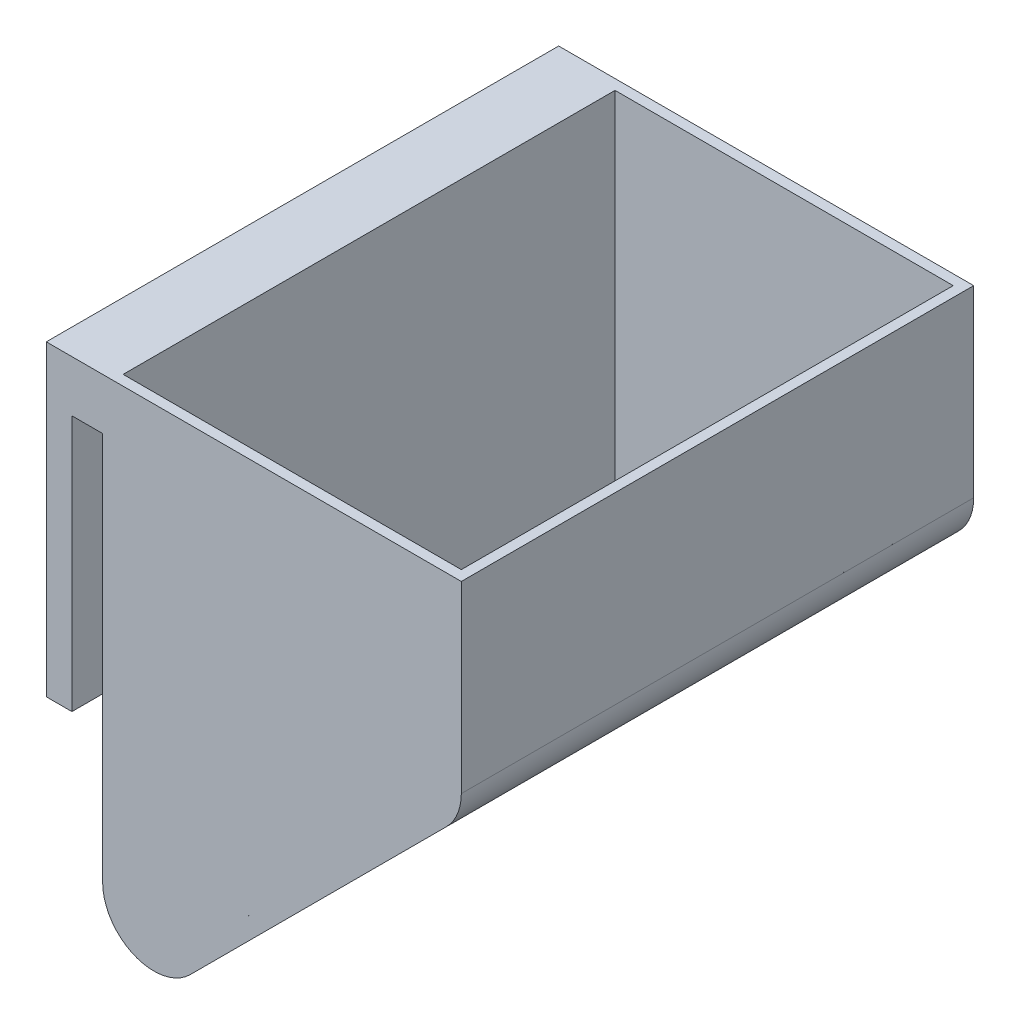
ISO-10303-21;
HEADER;
FILE_DESCRIPTION(('STEP AP214'),'2;1');
FILE_NAME('part.step','',(''),(''),'','','');
FILE_SCHEMA(('AUTOMOTIVE_DESIGN { 1 0 10303 214 1 1 1 1 }'));
ENDSEC;
DATA;
#1=APPLICATION_CONTEXT('core data for automotive mechanical design processes');
#2=APPLICATION_PROTOCOL_DEFINITION('international standard','automotive_design',2000,#1);
#3=PRODUCT_CONTEXT('',#1,'mechanical');
#4=PRODUCT('Part','Part','',(#3));
#5=PRODUCT_RELATED_PRODUCT_CATEGORY('part','',(#4));
#6=PRODUCT_DEFINITION_FORMATION('','',#4);
#7=PRODUCT_DEFINITION_CONTEXT('part definition',#1,'design');
#8=PRODUCT_DEFINITION('design','',#6,#7);
#9=PRODUCT_DEFINITION_SHAPE('','',#8);
#10=(LENGTH_UNIT() NAMED_UNIT(*) SI_UNIT(.MILLI.,.METRE.));
#11=(NAMED_UNIT(*) PLANE_ANGLE_UNIT() SI_UNIT($,.RADIAN.));
#12=(NAMED_UNIT(*) SI_UNIT($,.STERADIAN.) SOLID_ANGLE_UNIT());
#13=UNCERTAINTY_MEASURE_WITH_UNIT(LENGTH_MEASURE(1.E-05),#10,'distance_accuracy_value','');
#14=(GEOMETRIC_REPRESENTATION_CONTEXT(3) GLOBAL_UNCERTAINTY_ASSIGNED_CONTEXT((#13)) GLOBAL_UNIT_ASSIGNED_CONTEXT((#10,
#11,#12)) REPRESENTATION_CONTEXT('',''));
#15=CARTESIAN_POINT('',(0.,0.,0.));
#16=DIRECTION('',(0.,0.,1.));
#17=DIRECTION('',(1.,0.,0.));
#18=AXIS2_PLACEMENT_3D('',#15,#16,#17);
#19=CARTESIAN_POINT('',(-11.,0.,100.));
#20=DIRECTION('',(0.,-1.,0.));
#21=DIRECTION('',(1.,0.,0.));
#22=AXIS2_PLACEMENT_3D('',#19,#20,#21);
#23=PLANE('',#22);
#24=DIRECTION('',(1.,0.,0.));
#25=VECTOR('',#24,1.);
#26=CARTESIAN_POINT('',(2.00000000000001,0.,98.));
#27=LINE('',#26,#25);
#28=CARTESIAN_POINT('',(2.00000000000001,0.,98.));
#29=VERTEX_POINT('',#28);
#30=CARTESIAN_POINT('',(68.,0.,98.));
#31=VERTEX_POINT('',#30);
#32=EDGE_CURVE('E167',#29,#31,#27,.T.);
#33=ORIENTED_EDGE('',*,*,#32,.F.);
#34=DIRECTION('',(0.,0.,1.));
#35=VECTOR('',#34,1.);
#36=CARTESIAN_POINT('',(2.00000000000002,0.,2.));
#37=LINE('',#36,#35);
#38=CARTESIAN_POINT('',(2.00000000000002,0.,2.));
#39=VERTEX_POINT('',#38);
#40=EDGE_CURVE('E173',#39,#29,#37,.T.);
#41=ORIENTED_EDGE('',*,*,#40,.F.);
#42=DIRECTION('',(-1.,0.,0.));
#43=VECTOR('',#42,1.);
#44=CARTESIAN_POINT('',(2.00000000000002,0.,2.));
#45=LINE('',#44,#43);
#46=CARTESIAN_POINT('',(68.,0.,2.));
#47=VERTEX_POINT('',#46);
#48=EDGE_CURVE('E177',#47,#39,#45,.T.);
#49=ORIENTED_EDGE('',*,*,#48,.F.);
#50=DIRECTION('',(0.,0.,-1.));
#51=VECTOR('',#50,1.);
#52=CARTESIAN_POINT('',(68.,0.,2.));
#53=LINE('',#52,#51);
#54=EDGE_CURVE('E158',#31,#47,#53,.T.);
#55=ORIENTED_EDGE('',*,*,#54,.F.);
#56=EDGE_LOOP('',(#33,#41,#49,#55));
#57=FACE_BOUND('',#56,.T.);
#58=DIRECTION('',(-1.,0.,0.));
#59=VECTOR('',#58,1.);
#60=CARTESIAN_POINT('',(-11.,0.,0.));
#61=LINE('',#60,#59);
#62=CARTESIAN_POINT('',(70.,0.,0.));
#63=VERTEX_POINT('',#62);
#64=CARTESIAN_POINT('',(-11.,0.,0.));
#65=VERTEX_POINT('',#64);
#66=EDGE_CURVE('E184',#63,#65,#61,.T.);
#67=ORIENTED_EDGE('',*,*,#66,.T.);
#68=DIRECTION('',(0.,0.,-1.));
#69=VECTOR('',#68,1.);
#70=CARTESIAN_POINT('',(-11.,0.,100.));
#71=LINE('',#70,#69);
#72=CARTESIAN_POINT('',(-11.,0.,100.));
#73=VERTEX_POINT('',#72);
#74=EDGE_CURVE('E235',#73,#65,#71,.T.);
#75=ORIENTED_EDGE('',*,*,#74,.F.);
#76=DIRECTION('',(-1.,0.,0.));
#77=VECTOR('',#76,1.);
#78=CARTESIAN_POINT('',(-11.,0.,100.));
#79=LINE('',#78,#77);
#80=CARTESIAN_POINT('',(70.,0.,100.));
#81=VERTEX_POINT('',#80);
#82=EDGE_CURVE('E187',#81,#73,#79,.T.);
#83=ORIENTED_EDGE('',*,*,#82,.F.);
#84=DIRECTION('',(0.,0.,-1.));
#85=VECTOR('',#84,1.);
#86=CARTESIAN_POINT('',(70.,0.,100.));
#87=LINE('',#86,#85);
#88=EDGE_CURVE('E205',#81,#63,#87,.T.);
#89=ORIENTED_EDGE('',*,*,#88,.T.);
#90=EDGE_LOOP('',(#67,#75,#83,#89));
#91=FACE_BOUND('',#90,.T.);
#92=ADVANCED_FACE('F37',(#57,#91),#23,.F.);
#93=CARTESIAN_POINT('',(-11.,0.,100.));
#94=DIRECTION('',(1.,0.,0.));
#95=DIRECTION('',(0.,1.,0.));
#96=AXIS2_PLACEMENT_3D('',#93,#94,#95);
#97=PLANE('',#96);
#98=DIRECTION('',(0.,-1.,0.));
#99=VECTOR('',#98,1.);
#100=CARTESIAN_POINT('',(-11.,0.,0.));
#101=LINE('',#100,#99);
#102=CARTESIAN_POINT('',(-11.,-60.,0.));
#103=VERTEX_POINT('',#102);
#104=EDGE_CURVE('E208',#65,#103,#101,.T.);
#105=ORIENTED_EDGE('',*,*,#104,.T.);
#106=DIRECTION('',(0.,0.,-1.));
#107=VECTOR('',#106,1.);
#108=CARTESIAN_POINT('',(-11.,-60.,100.));
#109=LINE('',#108,#107);
#110=CARTESIAN_POINT('',(-11.,-60.,100.));
#111=VERTEX_POINT('',#110);
#112=EDGE_CURVE('E232',#111,#103,#109,.T.);
#113=ORIENTED_EDGE('',*,*,#112,.F.);
#114=DIRECTION('',(0.,-1.,0.));
#115=VECTOR('',#114,1.);
#116=CARTESIAN_POINT('',(-11.,0.,100.));
#117=LINE('',#116,#115);
#118=EDGE_CURVE('E190',#73,#111,#117,.T.);
#119=ORIENTED_EDGE('',*,*,#118,.F.);
#120=ORIENTED_EDGE('',*,*,#74,.T.);
#121=EDGE_LOOP('',(#105,#113,#119,#120));
#122=FACE_BOUND('',#121,.T.);
#123=ADVANCED_FACE('F302',(#122),#97,.F.);
#124=CARTESIAN_POINT('',(-11.,-60.,100.));
#125=DIRECTION('',(0.,1.,0.));
#126=DIRECTION('',(0.,0.,1.));
#127=AXIS2_PLACEMENT_3D('',#124,#125,#126);
#128=PLANE('',#127);
#129=DIRECTION('',(1.,0.,0.));
#130=VECTOR('',#129,1.);
#131=CARTESIAN_POINT('',(-11.,-60.,0.));
#132=LINE('',#131,#130);
#133=CARTESIAN_POINT('',(-6.,-60.,0.));
#134=VERTEX_POINT('',#133);
#135=EDGE_CURVE('E210',#103,#134,#132,.T.);
#136=ORIENTED_EDGE('',*,*,#135,.T.);
#137=DIRECTION('',(0.,0.,-1.));
#138=VECTOR('',#137,1.);
#139=CARTESIAN_POINT('',(-6.,-60.,100.));
#140=LINE('',#139,#138);
#141=CARTESIAN_POINT('',(-6.,-60.,100.));
#142=VERTEX_POINT('',#141);
#143=EDGE_CURVE('E229',#142,#134,#140,.T.);
#144=ORIENTED_EDGE('',*,*,#143,.F.);
#145=DIRECTION('',(1.,0.,0.));
#146=VECTOR('',#145,1.);
#147=CARTESIAN_POINT('',(-11.,-60.,100.));
#148=LINE('',#147,#146);
#149=EDGE_CURVE('E193',#111,#142,#148,.T.);
#150=ORIENTED_EDGE('',*,*,#149,.F.);
#151=ORIENTED_EDGE('',*,*,#112,.T.);
#152=EDGE_LOOP('',(#136,#144,#150,#151));
#153=FACE_BOUND('',#152,.T.);
#154=ADVANCED_FACE('F306',(#153),#128,.F.);
#155=CARTESIAN_POINT('',(-6.,-60.,100.));
#156=DIRECTION('',(-1.,0.,0.));
#157=DIRECTION('',(0.,0.,1.));
#158=AXIS2_PLACEMENT_3D('',#155,#156,#157);
#159=PLANE('',#158);
#160=DIRECTION('',(0.,1.,0.));
#161=VECTOR('',#160,1.);
#162=CARTESIAN_POINT('',(-6.,-60.,0.));
#163=LINE('',#162,#161);
#164=CARTESIAN_POINT('',(-6.,-10.,0.));
#165=VERTEX_POINT('',#164);
#166=EDGE_CURVE('E212',#134,#165,#163,.T.);
#167=ORIENTED_EDGE('',*,*,#166,.T.);
#168=DIRECTION('',(0.,0.,-1.));
#169=VECTOR('',#168,1.);
#170=CARTESIAN_POINT('',(-6.,-10.,100.));
#171=LINE('',#170,#169);
#172=CARTESIAN_POINT('',(-6.,-10.,100.));
#173=VERTEX_POINT('',#172);
#174=EDGE_CURVE('E226',#173,#165,#171,.T.);
#175=ORIENTED_EDGE('',*,*,#174,.F.);
#176=DIRECTION('',(0.,1.,0.));
#177=VECTOR('',#176,1.);
#178=CARTESIAN_POINT('',(-6.,-60.,100.));
#179=LINE('',#178,#177);
#180=EDGE_CURVE('E195',#142,#173,#179,.T.);
#181=ORIENTED_EDGE('',*,*,#180,.F.);
#182=ORIENTED_EDGE('',*,*,#143,.T.);
#183=EDGE_LOOP('',(#167,#175,#181,#182));
#184=FACE_BOUND('',#183,.T.);
#185=ADVANCED_FACE('F312',(#184),#159,.F.);
#186=CARTESIAN_POINT('',(-6.,-10.,100.));
#187=DIRECTION('',(0.,1.,0.));
#188=DIRECTION('',(-1.,0.,0.));
#189=AXIS2_PLACEMENT_3D('',#186,#187,#188);
#190=PLANE('',#189);
#191=DIRECTION('',(1.,0.,0.));
#192=VECTOR('',#191,1.);
#193=CARTESIAN_POINT('',(-6.,-10.,0.));
#194=LINE('',#193,#192);
#195=CARTESIAN_POINT('',(0.,-10.,0.));
#196=VERTEX_POINT('',#195);
#197=EDGE_CURVE('E214',#165,#196,#194,.T.);
#198=ORIENTED_EDGE('',*,*,#197,.T.);
#199=DIRECTION('',(0.,0.,-1.));
#200=VECTOR('',#199,1.);
#201=CARTESIAN_POINT('',(0.,-10.,100.));
#202=LINE('',#201,#200);
#203=CARTESIAN_POINT('',(0.,-10.,100.));
#204=VERTEX_POINT('',#203);
#205=EDGE_CURVE('E223',#204,#196,#202,.T.);
#206=ORIENTED_EDGE('',*,*,#205,.F.);
#207=DIRECTION('',(1.,0.,0.));
#208=VECTOR('',#207,1.);
#209=CARTESIAN_POINT('',(-6.,-10.,100.));
#210=LINE('',#209,#208);
#211=EDGE_CURVE('E197',#173,#204,#210,.T.);
#212=ORIENTED_EDGE('',*,*,#211,.F.);
#213=ORIENTED_EDGE('',*,*,#174,.T.);
#214=EDGE_LOOP('',(#198,#206,#212,#213));
#215=FACE_BOUND('',#214,.T.);
#216=ADVANCED_FACE('F316',(#215),#190,.F.);
#217=CARTESIAN_POINT('',(0.,-10.,100.));
#218=DIRECTION('',(1.,0.,0.));
#219=DIRECTION('',(0.,1.,0.));
#220=AXIS2_PLACEMENT_3D('',#217,#218,#219);
#221=PLANE('',#220);
#222=DIRECTION('',(0.,-1.,0.));
#223=VECTOR('',#222,1.);
#224=CARTESIAN_POINT('',(0.,-10.,0.));
#225=LINE('',#224,#223);
#226=CARTESIAN_POINT('',(0.,-85.8578643762689,0.));
#227=VERTEX_POINT('',#226);
#228=EDGE_CURVE('E216',#196,#227,#225,.T.);
#229=ORIENTED_EDGE('',*,*,#228,.T.);
#230=DIRECTION('',(0.,0.,-1.));
#231=VECTOR('',#230,1.);
#232=CARTESIAN_POINT('',(0.,-85.8578643762689,100.));
#233=LINE('',#232,#231);
#234=CARTESIAN_POINT('',(0.,-85.8578643762689,100.));
#235=VERTEX_POINT('',#234);
#236=EDGE_CURVE('E11',#227,#235,#233,.F.);
#237=ORIENTED_EDGE('',*,*,#236,.T.);
#238=DIRECTION('',(0.,-1.,0.));
#239=VECTOR('',#238,1.);
#240=CARTESIAN_POINT('',(0.,-10.,100.));
#241=LINE('',#240,#239);
#242=EDGE_CURVE('E199',#204,#235,#241,.T.);
#243=ORIENTED_EDGE('',*,*,#242,.F.);
#244=ORIENTED_EDGE('',*,*,#205,.T.);
#245=EDGE_LOOP('',(#229,#237,#243,#244));
#246=FACE_BOUND('',#245,.T.);
#247=ADVANCED_FACE('F320',(#246),#221,.F.);
#248=CARTESIAN_POINT('',(0.,-110.,100.));
#249=DIRECTION('',(-0.707106781186552,0.707106781186543,0.));
#250=DIRECTION('',(-0.707106781186543,-0.707106781186552,0.));
#251=AXIS2_PLACEMENT_3D('',#248,#249,#250);
#252=PLANE('',#251);
#253=DIRECTION('',(0.707106781186543,0.707106781186552,0.));
#254=VECTOR('',#253,1.);
#255=CARTESIAN_POINT('',(0.,-110.,0.));
#256=LINE('',#255,#254);
#257=CARTESIAN_POINT('',(17.0710678118655,-92.9289321881343,0.));
#258=VERTEX_POINT('',#257);
#259=CARTESIAN_POINT('',(67.0710678118655,-42.9289321881337,0.));
#260=VERTEX_POINT('',#259);
#261=EDGE_CURVE('E218',#258,#260,#256,.T.);
#262=ORIENTED_EDGE('',*,*,#261,.T.);
#263=DIRECTION('',(0.,0.,-1.));
#264=VECTOR('',#263,1.);
#265=CARTESIAN_POINT('',(67.0710678118655,-42.9289321881337,100.));
#266=LINE('',#265,#264);
#267=CARTESIAN_POINT('',(67.0710678118655,-42.9289321881337,100.));
#268=VERTEX_POINT('',#267);
#269=EDGE_CURVE('E58',#260,#268,#266,.F.);
#270=ORIENTED_EDGE('',*,*,#269,.T.);
#271=DIRECTION('',(0.707106781186543,0.707106781186552,0.));
#272=VECTOR('',#271,1.);
#273=CARTESIAN_POINT('',(0.,-110.,100.));
#274=LINE('',#273,#272);
#275=CARTESIAN_POINT('',(17.0710678118655,-92.9289321881343,100.));
#276=VERTEX_POINT('',#275);
#277=EDGE_CURVE('E201',#276,#268,#274,.T.);
#278=ORIENTED_EDGE('',*,*,#277,.F.);
#279=DIRECTION('',(0.,0.,-1.));
#280=VECTOR('',#279,1.);
#281=CARTESIAN_POINT('',(17.0710678118655,-92.9289321881343,100.));
#282=LINE('',#281,#280);
#283=EDGE_CURVE('E259',#276,#258,#282,.T.);
#284=ORIENTED_EDGE('',*,*,#283,.T.);
#285=EDGE_LOOP('',(#262,#270,#278,#284));
#286=FACE_BOUND('',#285,.T.);
#287=ADVANCED_FACE('F324',(#286),#252,.F.);
#288=CARTESIAN_POINT('',(70.,0.,100.));
#289=DIRECTION('',(-1.,0.,0.));
#290=DIRECTION('',(0.,-1.,0.));
#291=AXIS2_PLACEMENT_3D('',#288,#289,#290);
#292=PLANE('',#291);
#293=DIRECTION('',(0.,1.,0.));
#294=VECTOR('',#293,1.);
#295=CARTESIAN_POINT('',(70.,0.,100.));
#296=LINE('',#295,#294);
#297=CARTESIAN_POINT('',(70.,-35.8578643762683,100.));
#298=VERTEX_POINT('',#297);
#299=EDGE_CURVE('E203',#298,#81,#296,.T.);
#300=ORIENTED_EDGE('',*,*,#299,.F.);
#301=DIRECTION('',(0.,0.,-1.));
#302=VECTOR('',#301,1.);
#303=CARTESIAN_POINT('',(70.,-35.8578643762683,100.));
#304=LINE('',#303,#302);
#305=CARTESIAN_POINT('',(70.,-35.8578643762683,0.));
#306=VERTEX_POINT('',#305);
#307=EDGE_CURVE('E252',#298,#306,#304,.T.);
#308=ORIENTED_EDGE('',*,*,#307,.T.);
#309=DIRECTION('',(0.,1.,0.));
#310=VECTOR('',#309,1.);
#311=CARTESIAN_POINT('',(70.,0.,0.));
#312=LINE('',#311,#310);
#313=EDGE_CURVE('E191',#306,#63,#312,.T.);
#314=ORIENTED_EDGE('',*,*,#313,.T.);
#315=ORIENTED_EDGE('',*,*,#88,.F.);
#316=EDGE_LOOP('',(#300,#308,#314,#315));
#317=FACE_BOUND('',#316,.T.);
#318=ADVANCED_FACE('F327',(#317),#292,.F.);
#319=CARTESIAN_POINT('',(0.,0.,100.));
#320=DIRECTION('',(0.,0.,-1.));
#321=DIRECTION('',(-1.,0.,0.));
#322=AXIS2_PLACEMENT_3D('',#319,#320,#321);
#323=PLANE('',#322);
#324=ORIENTED_EDGE('',*,*,#277,.T.);
#325=CARTESIAN_POINT('',(60.,-35.8578643762683,100.));
#326=DIRECTION('',(0.,0.,-1.));
#327=DIRECTION('',(-1.,0.,0.));
#328=AXIS2_PLACEMENT_3D('',#325,#326,#327);
#329=CIRCLE('',#328,10.);
#330=EDGE_CURVE('E265',#268,#298,#329,.F.);
#331=ORIENTED_EDGE('',*,*,#330,.T.);
#332=ORIENTED_EDGE('',*,*,#299,.T.);
#333=ORIENTED_EDGE('',*,*,#82,.T.);
#334=ORIENTED_EDGE('',*,*,#118,.T.);
#335=ORIENTED_EDGE('',*,*,#149,.T.);
#336=ORIENTED_EDGE('',*,*,#180,.T.);
#337=ORIENTED_EDGE('',*,*,#211,.T.);
#338=ORIENTED_EDGE('',*,*,#242,.T.);
#339=CARTESIAN_POINT('',(10.,-85.8578643762689,100.));
#340=DIRECTION('',(0.,0.,-1.));
#341=DIRECTION('',(-1.,0.,0.));
#342=AXIS2_PLACEMENT_3D('',#339,#340,#341);
#343=CIRCLE('',#342,10.);
#344=EDGE_CURVE('E263',#235,#276,#343,.F.);
#345=ORIENTED_EDGE('',*,*,#344,.T.);
#346=EDGE_LOOP('',(#324,#331,#332,#333,#334,#335,#336,#337,#338,#345));
#347=FACE_BOUND('',#346,.T.);
#348=ADVANCED_FACE('F330',(#347),#323,.F.);
#349=CARTESIAN_POINT('',(0.,0.,0.));
#350=DIRECTION('',(0.,0.,-1.));
#351=DIRECTION('',(-1.,0.,0.));
#352=AXIS2_PLACEMENT_3D('',#349,#350,#351);
#353=PLANE('',#352);
#354=ORIENTED_EDGE('',*,*,#313,.F.);
#355=CARTESIAN_POINT('',(60.,-35.8578643762683,0.));
#356=DIRECTION('',(0.,0.,-1.));
#357=DIRECTION('',(-1.,0.,0.));
#358=AXIS2_PLACEMENT_3D('',#355,#356,#357);
#359=CIRCLE('',#358,10.);
#360=EDGE_CURVE('E257',#306,#260,#359,.T.);
#361=ORIENTED_EDGE('',*,*,#360,.T.);
#362=ORIENTED_EDGE('',*,*,#261,.F.);
#363=CARTESIAN_POINT('',(10.,-85.8578643762689,0.));
#364=DIRECTION('',(0.,0.,-1.));
#365=DIRECTION('',(-1.,0.,0.));
#366=AXIS2_PLACEMENT_3D('',#363,#364,#365);
#367=CIRCLE('',#366,10.);
#368=EDGE_CURVE('E255',#258,#227,#367,.T.);
#369=ORIENTED_EDGE('',*,*,#368,.T.);
#370=ORIENTED_EDGE('',*,*,#228,.F.);
#371=ORIENTED_EDGE('',*,*,#197,.F.);
#372=ORIENTED_EDGE('',*,*,#166,.F.);
#373=ORIENTED_EDGE('',*,*,#135,.F.);
#374=ORIENTED_EDGE('',*,*,#104,.F.);
#375=ORIENTED_EDGE('',*,*,#66,.F.);
#376=EDGE_LOOP('',(#354,#361,#362,#369,#370,#371,#372,#373,#374,#375));
#377=FACE_BOUND('',#376,.T.);
#378=ADVANCED_FACE('F332',(#377),#353,.T.);
#379=CARTESIAN_POINT('',(2.00000000000002,-10.,2.));
#380=DIRECTION('',(-1.,0.,0.));
#381=DIRECTION('',(0.,-1.,0.));
#382=AXIS2_PLACEMENT_3D('',#379,#380,#381);
#383=PLANE('',#382);
#384=DIRECTION('',(0.,1.,0.));
#385=VECTOR('',#384,1.);
#386=CARTESIAN_POINT('',(2.00000000000001,-10.,98.));
#387=LINE('',#386,#385);
#388=CARTESIAN_POINT('',(2.00000000000003,-79.6169237196718,98.));
#389=VERTEX_POINT('',#388);
#390=EDGE_CURVE('E164',#389,#29,#387,.T.);
#391=ORIENTED_EDGE('',*,*,#390,.F.);
#392=DIRECTION('',(0.,0.,1.));
#393=VECTOR('',#392,1.);
#394=CARTESIAN_POINT('',(2.00000000000003,-79.6169237196718,1.99999999999993));
#395=LINE('',#394,#393);
#396=CARTESIAN_POINT('',(2.00000000000003,-79.6169237196718,2.));
#397=VERTEX_POINT('',#396);
#398=EDGE_CURVE('E45',#389,#397,#395,.F.);
#399=ORIENTED_EDGE('',*,*,#398,.T.);
#400=DIRECTION('',(0.,1.,0.));
#401=VECTOR('',#400,1.);
#402=CARTESIAN_POINT('',(2.00000000000002,-10.,2.));
#403=LINE('',#402,#401);
#404=EDGE_CURVE('E182',#397,#39,#403,.T.);
#405=ORIENTED_EDGE('',*,*,#404,.T.);
#406=ORIENTED_EDGE('',*,*,#40,.T.);
#407=EDGE_LOOP('',(#391,#399,#405,#406));
#408=FACE_BOUND('',#407,.T.);
#409=ADVANCED_FACE('F269',(#408),#383,.F.);
#410=CARTESIAN_POINT('',(2.00000000000002,-10.,2.));
#411=DIRECTION('',(0.,0.,-1.));
#412=DIRECTION('',(-1.,0.,0.));
#413=AXIS2_PLACEMENT_3D('',#410,#411,#412);
#414=PLANE('',#413);
#415=DIRECTION('',(0.70714199121114,0.707071569408603,0.));
#416=VECTOR('',#415,1.);
#417=CARTESIAN_POINT('',(2.00000000000002,-103.757359312881,1.99999999999993));
#418=LINE('',#417,#416);
#419=CARTESIAN_POINT('',(19.0707156940861,-86.6883436317832,1.99999999999993));
#420=VERTEX_POINT('',#419);
#421=CARTESIAN_POINT('',(65.070715694086,-40.6929246112144,1.99999999999993));
#422=VERTEX_POINT('',#421);
#423=EDGE_CURVE('E284',#420,#422,#418,.T.);
#424=ORIENTED_EDGE('',*,*,#423,.T.);
#425=CARTESIAN_POINT('',(58.,-33.621504699103,2.));
#426=DIRECTION('',(0.,0.,-1.));
#427=DIRECTION('',(-1.,0.,0.));
#428=AXIS2_PLACEMENT_3D('',#425,#426,#427);
#429=CIRCLE('',#428,10.);
#430=CARTESIAN_POINT('',(68.,-33.621504699103,2.));
#431=VERTEX_POINT('',#430);
#432=EDGE_CURVE('E250',#422,#431,#429,.F.);
#433=ORIENTED_EDGE('',*,*,#432,.T.);
#434=DIRECTION('',(0.,1.,0.));
#435=VECTOR('',#434,1.);
#436=CARTESIAN_POINT('',(68.,-9.99999999999999,2.));
#437=LINE('',#436,#435);
#438=EDGE_CURVE('E163',#431,#47,#437,.T.);
#439=ORIENTED_EDGE('',*,*,#438,.T.);
#440=ORIENTED_EDGE('',*,*,#48,.T.);
#441=ORIENTED_EDGE('',*,*,#404,.F.);
#442=CARTESIAN_POINT('',(12.,-79.6169237196718,2.));
#443=DIRECTION('',(0.,0.,-1.));
#444=DIRECTION('',(-1.,0.,0.));
#445=AXIS2_PLACEMENT_3D('',#442,#443,#444);
#446=CIRCLE('',#445,10.);
#447=EDGE_CURVE('E248',#397,#420,#446,.F.);
#448=ORIENTED_EDGE('',*,*,#447,.T.);
#449=EDGE_LOOP('',(#424,#433,#439,#440,#441,#448));
#450=FACE_BOUND('',#449,.T.);
#451=ADVANCED_FACE('F274',(#450),#414,.F.);
#452=CARTESIAN_POINT('',(68.,-9.99999999999999,2.));
#453=DIRECTION('',(1.,0.,0.));
#454=DIRECTION('',(0.,1.,0.));
#455=AXIS2_PLACEMENT_3D('',#452,#453,#454);
#456=PLANE('',#455);
#457=ORIENTED_EDGE('',*,*,#438,.F.);
#458=DIRECTION('',(0.,0.,1.));
#459=VECTOR('',#458,1.);
#460=CARTESIAN_POINT('',(68.,-33.621504699103,98.));
#461=LINE('',#460,#459);
#462=CARTESIAN_POINT('',(68.,-33.621504699103,98.));
#463=VERTEX_POINT('',#462);
#464=EDGE_CURVE('E161',#431,#463,#461,.T.);
#465=ORIENTED_EDGE('',*,*,#464,.T.);
#466=DIRECTION('',(0.,1.,0.));
#467=VECTOR('',#466,1.);
#468=CARTESIAN_POINT('',(68.,-9.99999999999999,98.));
#469=LINE('',#468,#467);
#470=EDGE_CURVE('E153',#463,#31,#469,.T.);
#471=ORIENTED_EDGE('',*,*,#470,.T.);
#472=ORIENTED_EDGE('',*,*,#54,.T.);
#473=EDGE_LOOP('',(#457,#465,#471,#472));
#474=FACE_BOUND('',#473,.T.);
#475=ADVANCED_FACE('F156',(#474),#456,.F.);
#476=CARTESIAN_POINT('',(2.00000000000001,-10.,98.));
#477=DIRECTION('',(0.,0.,1.));
#478=DIRECTION('',(1.,0.,0.));
#479=AXIS2_PLACEMENT_3D('',#476,#477,#478);
#480=PLANE('',#479);
#481=ORIENTED_EDGE('',*,*,#470,.F.);
#482=CARTESIAN_POINT('',(58.,-33.621504699103,98.));
#483=DIRECTION('',(0.,0.,1.));
#484=DIRECTION('',(1.,0.,0.));
#485=AXIS2_PLACEMENT_3D('',#482,#483,#484);
#486=CIRCLE('',#485,10.);
#487=CARTESIAN_POINT('',(65.070715694086,-40.6929246112144,98.));
#488=VERTEX_POINT('',#487);
#489=EDGE_CURVE('E241',#463,#488,#486,.F.);
#490=ORIENTED_EDGE('',*,*,#489,.T.);
#491=DIRECTION('',(0.70714199121114,0.707071569408603,0.));
#492=VECTOR('',#491,1.);
#493=CARTESIAN_POINT('',(2.00000000000002,-103.757359312881,98.));
#494=LINE('',#493,#492);
#495=CARTESIAN_POINT('',(19.0707156940861,-86.6883436317832,98.));
#496=VERTEX_POINT('',#495);
#497=EDGE_CURVE('E282',#496,#488,#494,.T.);
#498=ORIENTED_EDGE('',*,*,#497,.F.);
#499=CARTESIAN_POINT('',(12.,-79.6169237196718,98.));
#500=DIRECTION('',(0.,0.,1.));
#501=DIRECTION('',(1.,0.,0.));
#502=AXIS2_PLACEMENT_3D('',#499,#500,#501);
#503=CIRCLE('',#502,10.);
#504=EDGE_CURVE('E239',#496,#389,#503,.F.);
#505=ORIENTED_EDGE('',*,*,#504,.T.);
#506=ORIENTED_EDGE('',*,*,#390,.T.);
#507=ORIENTED_EDGE('',*,*,#32,.T.);
#508=EDGE_LOOP('',(#481,#490,#498,#505,#506,#507));
#509=FACE_BOUND('',#508,.T.);
#510=ADVANCED_FACE('F168',(#509),#480,.F.);
#511=CARTESIAN_POINT('',(2.00000000000002,-103.757359312881,1.99999999999993));
#512=DIRECTION('',(0.707071569408603,-0.70714199121114,0.));
#513=DIRECTION('',(0.70714199121114,0.707071569408603,0.));
#514=AXIS2_PLACEMENT_3D('',#511,#512,#513);
#515=PLANE('',#514);
#516=ORIENTED_EDGE('',*,*,#497,.T.);
#517=DIRECTION('',(0.,0.,1.));
#518=VECTOR('',#517,1.);
#519=CARTESIAN_POINT('',(65.070715694086,-40.6929246112144,1.99999999999993));
#520=LINE('',#519,#518);
#521=EDGE_CURVE('E246',#488,#422,#520,.F.);
#522=ORIENTED_EDGE('',*,*,#521,.T.);
#523=ORIENTED_EDGE('',*,*,#423,.F.);
#524=DIRECTION('',(0.,0.,1.));
#525=VECTOR('',#524,1.);
#526=CARTESIAN_POINT('',(19.0707156940861,-86.6883436317832,98.));
#527=LINE('',#526,#525);
#528=EDGE_CURVE('E243',#420,#496,#527,.T.);
#529=ORIENTED_EDGE('',*,*,#528,.T.);
#530=EDGE_LOOP('',(#516,#522,#523,#529));
#531=FACE_BOUND('',#530,.T.);
#532=ADVANCED_FACE('F281',(#531),#515,.F.);
#533=CARTESIAN_POINT('',(58.,-33.621504699103,2.));
#534=DIRECTION('',(0.,0.,-1.));
#535=DIRECTION('',(-1.,0.,0.));
#536=AXIS2_PLACEMENT_3D('',#533,#534,#535);
#537=CYLINDRICAL_SURFACE('',#536,10.);
#538=ORIENTED_EDGE('',*,*,#432,.F.);
#539=ORIENTED_EDGE('',*,*,#521,.F.);
#540=ORIENTED_EDGE('',*,*,#489,.F.);
#541=ORIENTED_EDGE('',*,*,#464,.F.);
#542=EDGE_LOOP('',(#538,#539,#540,#541));
#543=FACE_BOUND('',#542,.T.);
#544=ADVANCED_FACE('F289',(#543),#537,.F.);
#545=CARTESIAN_POINT('',(60.,-35.8578643762683,100.));
#546=DIRECTION('',(0.,0.,-1.));
#547=DIRECTION('',(-1.,0.,0.));
#548=AXIS2_PLACEMENT_3D('',#545,#546,#547);
#549=CYLINDRICAL_SURFACE('',#548,10.);
#550=ORIENTED_EDGE('',*,*,#330,.F.);
#551=ORIENTED_EDGE('',*,*,#269,.F.);
#552=ORIENTED_EDGE('',*,*,#360,.F.);
#553=ORIENTED_EDGE('',*,*,#307,.F.);
#554=EDGE_LOOP('',(#550,#551,#552,#553));
#555=FACE_BOUND('',#554,.T.);
#556=ADVANCED_FACE('F291',(#555),#549,.T.);
#557=CARTESIAN_POINT('',(12.,-79.6169237196718,1.99999999999993));
#558=DIRECTION('',(0.,0.,-1.));
#559=DIRECTION('',(-1.,0.,0.));
#560=AXIS2_PLACEMENT_3D('',#557,#558,#559);
#561=CYLINDRICAL_SURFACE('',#560,10.);
#562=ORIENTED_EDGE('',*,*,#447,.F.);
#563=ORIENTED_EDGE('',*,*,#398,.F.);
#564=ORIENTED_EDGE('',*,*,#504,.F.);
#565=ORIENTED_EDGE('',*,*,#528,.F.);
#566=EDGE_LOOP('',(#562,#563,#564,#565));
#567=FACE_BOUND('',#566,.T.);
#568=ADVANCED_FACE('F277',(#567),#561,.F.);
#569=CARTESIAN_POINT('',(10.,-85.8578643762689,100.));
#570=DIRECTION('',(0.,0.,-1.));
#571=DIRECTION('',(-1.,0.,0.));
#572=AXIS2_PLACEMENT_3D('',#569,#570,#571);
#573=CYLINDRICAL_SURFACE('',#572,10.);
#574=ORIENTED_EDGE('',*,*,#344,.F.);
#575=ORIENTED_EDGE('',*,*,#236,.F.);
#576=ORIENTED_EDGE('',*,*,#368,.F.);
#577=ORIENTED_EDGE('',*,*,#283,.F.);
#578=EDGE_LOOP('',(#574,#575,#576,#577));
#579=FACE_BOUND('',#578,.T.);
#580=ADVANCED_FACE('F39',(#579),#573,.T.);
#581=CLOSED_SHELL('',(#92,#123,#154,#185,#216,#247,#287,#318,#348,#378,#409,#451,#475,#510,#532,
#544,#556,#568,#580));
#582=MANIFOLD_SOLID_BREP('B2',#581);
#583=ADVANCED_BREP_SHAPE_REPRESENTATION('',(#18,#582),#14);
#584=SHAPE_DEFINITION_REPRESENTATION(#9,#583);
ENDSEC;
END-ISO-10303-21;
